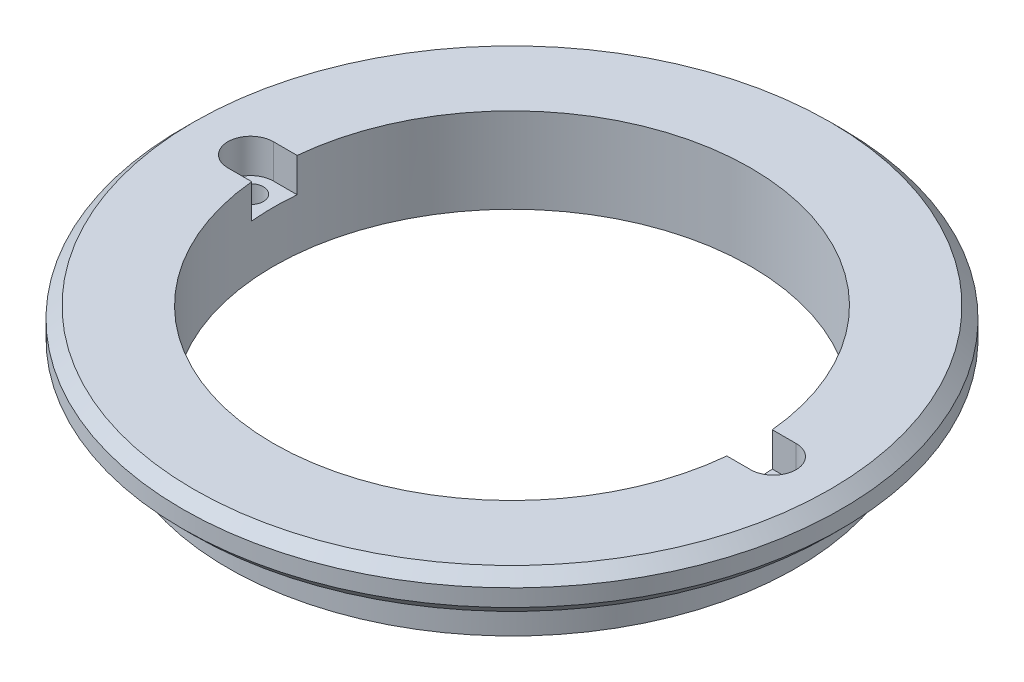
ISO-10303-21;
HEADER;
FILE_DESCRIPTION(('STEP AP214'),'2;1');
FILE_NAME('part.step','',(''),(''),'','','');
FILE_SCHEMA(('AUTOMOTIVE_DESIGN { 1 0 10303 214 1 1 1 1 }'));
ENDSEC;
DATA;
#1=APPLICATION_CONTEXT('core data for automotive mechanical design processes');
#2=APPLICATION_PROTOCOL_DEFINITION('international standard','automotive_design',2000,#1);
#3=PRODUCT_CONTEXT('',#1,'mechanical');
#4=PRODUCT('Part','Part','',(#3));
#5=PRODUCT_RELATED_PRODUCT_CATEGORY('part','',(#4));
#6=PRODUCT_DEFINITION_FORMATION('','',#4);
#7=PRODUCT_DEFINITION_CONTEXT('part definition',#1,'design');
#8=PRODUCT_DEFINITION('design','',#6,#7);
#9=PRODUCT_DEFINITION_SHAPE('','',#8);
#10=(LENGTH_UNIT() NAMED_UNIT(*) SI_UNIT(.MILLI.,.METRE.));
#11=(NAMED_UNIT(*) PLANE_ANGLE_UNIT() SI_UNIT($,.RADIAN.));
#12=(NAMED_UNIT(*) SI_UNIT($,.STERADIAN.) SOLID_ANGLE_UNIT());
#13=UNCERTAINTY_MEASURE_WITH_UNIT(LENGTH_MEASURE(1.E-05),#10,'distance_accuracy_value','');
#14=(GEOMETRIC_REPRESENTATION_CONTEXT(3) GLOBAL_UNCERTAINTY_ASSIGNED_CONTEXT((#13)) GLOBAL_UNIT_ASSIGNED_CONTEXT((#10,
#11,#12)) REPRESENTATION_CONTEXT('',''));
#15=CARTESIAN_POINT('',(0.,0.,0.));
#16=DIRECTION('',(0.,0.,1.));
#17=DIRECTION('',(1.,0.,0.));
#18=AXIS2_PLACEMENT_3D('',#15,#16,#17);
#19=CARTESIAN_POINT('',(23.,7.5,0.));
#20=DIRECTION('',(0.,-1.,0.));
#21=DIRECTION('',(0.,0.,-1.));
#22=AXIS2_PLACEMENT_3D('',#19,#20,#21);
#23=CYLINDRICAL_SURFACE('',#22,1.125);
#24=CARTESIAN_POINT('',(23.,0.,0.));
#25=DIRECTION('',(0.,-1.,0.));
#26=DIRECTION('',(0.,0.,-1.));
#27=AXIS2_PLACEMENT_3D('',#24,#25,#26);
#28=CIRCLE('',#27,1.125);
#29=CARTESIAN_POINT('',(23.,0.,-1.125));
#30=VERTEX_POINT('',#29);
#31=EDGE_CURVE('E191',#30,#30,#28,.T.);
#32=ORIENTED_EDGE('',*,*,#31,.T.);
#33=EDGE_LOOP('',(#32));
#34=FACE_BOUND('',#33,.T.);
#35=CARTESIAN_POINT('',(23.,4.5,0.));
#36=DIRECTION('',(0.,1.,0.));
#37=DIRECTION('',(0.,0.,1.));
#38=AXIS2_PLACEMENT_3D('',#35,#36,#37);
#39=CIRCLE('',#38,1.125);
#40=CARTESIAN_POINT('',(23.,4.5,1.125));
#41=VERTEX_POINT('',#40);
#42=EDGE_CURVE('E171',#41,#41,#39,.F.);
#43=ORIENTED_EDGE('',*,*,#42,.F.);
#44=EDGE_LOOP('',(#43));
#45=FACE_BOUND('',#44,.T.);
#46=ADVANCED_FACE('F45',(#34,#45),#23,.F.);
#47=CARTESIAN_POINT('',(-23.,7.5,0.));
#48=DIRECTION('',(0.,-1.,0.));
#49=DIRECTION('',(0.,0.,-1.));
#50=AXIS2_PLACEMENT_3D('',#47,#48,#49);
#51=CYLINDRICAL_SURFACE('',#50,1.125);
#52=CARTESIAN_POINT('',(-23.,0.,0.));
#53=DIRECTION('',(0.,-1.,0.));
#54=DIRECTION('',(0.,0.,-1.));
#55=AXIS2_PLACEMENT_3D('',#52,#53,#54);
#56=CIRCLE('',#55,1.125);
#57=CARTESIAN_POINT('',(-23.,0.,-1.125));
#58=VERTEX_POINT('',#57);
#59=EDGE_CURVE('E192',#58,#58,#56,.T.);
#60=ORIENTED_EDGE('',*,*,#59,.T.);
#61=EDGE_LOOP('',(#60));
#62=FACE_BOUND('',#61,.T.);
#63=CARTESIAN_POINT('',(-23.,4.5,0.));
#64=DIRECTION('',(0.,1.,0.));
#65=DIRECTION('',(0.,0.,1.));
#66=AXIS2_PLACEMENT_3D('',#63,#64,#65);
#67=CIRCLE('',#66,1.125);
#68=CARTESIAN_POINT('',(-23.,4.5,1.125));
#69=VERTEX_POINT('',#68);
#70=EDGE_CURVE('E49',#69,#69,#67,.F.);
#71=ORIENTED_EDGE('',*,*,#70,.F.);
#72=EDGE_LOOP('',(#71));
#73=FACE_BOUND('',#72,.T.);
#74=ADVANCED_FACE('F291',(#62,#73),#51,.F.);
#75=CARTESIAN_POINT('',(0.,0.,0.));
#76=DIRECTION('',(0.,-1.,0.));
#77=DIRECTION('',(0.,0.,-1.));
#78=AXIS2_PLACEMENT_3D('',#75,#76,#77);
#79=CYLINDRICAL_SURFACE('',#78,21.);
#80=CARTESIAN_POINT('',(0.,7.5,0.));
#81=DIRECTION('',(0.,-1.,0.));
#82=DIRECTION('',(0.,0.,-1.));
#83=AXIS2_PLACEMENT_3D('',#80,#81,#82);
#84=CIRCLE('',#83,21.);
#85=CARTESIAN_POINT('',(-20.9045449603669,7.5,-2.));
#86=VERTEX_POINT('',#85);
#87=CARTESIAN_POINT('',(20.9045449603669,7.5,-2.));
#88=VERTEX_POINT('',#87);
#89=EDGE_CURVE('E196',#86,#88,#84,.T.);
#90=ORIENTED_EDGE('',*,*,#89,.F.);
#91=DIRECTION('',(0.,-1.,0.));
#92=VECTOR('',#91,1.);
#93=CARTESIAN_POINT('',(-20.9045449603669,0.,-2.));
#94=LINE('',#93,#92);
#95=CARTESIAN_POINT('',(-20.9045449603669,4.5,-2.));
#96=VERTEX_POINT('',#95);
#97=EDGE_CURVE('E183',#86,#96,#94,.T.);
#98=ORIENTED_EDGE('',*,*,#97,.T.);
#99=CARTESIAN_POINT('',(0.,4.5,0.));
#100=DIRECTION('',(0.,1.,0.));
#101=DIRECTION('',(0.,0.,1.));
#102=AXIS2_PLACEMENT_3D('',#99,#100,#101);
#103=CIRCLE('',#102,21.);
#104=CARTESIAN_POINT('',(-20.9045449603669,4.5,2.));
#105=VERTEX_POINT('',#104);
#106=EDGE_CURVE('E178',#105,#96,#103,.F.);
#107=ORIENTED_EDGE('',*,*,#106,.F.);
#108=DIRECTION('',(0.,-1.,0.));
#109=VECTOR('',#108,1.);
#110=CARTESIAN_POINT('',(-20.9045449603669,0.,2.));
#111=LINE('',#110,#109);
#112=CARTESIAN_POINT('',(-20.9045449603669,7.5,2.));
#113=VERTEX_POINT('',#112);
#114=EDGE_CURVE('E127',#105,#113,#111,.F.);
#115=ORIENTED_EDGE('',*,*,#114,.T.);
#116=CARTESIAN_POINT('',(20.9045449603669,7.5,2.));
#117=VERTEX_POINT('',#116);
#118=EDGE_CURVE('E203',#117,#113,#84,.T.);
#119=ORIENTED_EDGE('',*,*,#118,.F.);
#120=DIRECTION('',(0.,-1.,0.));
#121=VECTOR('',#120,1.);
#122=CARTESIAN_POINT('',(20.9045449603669,0.,2.));
#123=LINE('',#122,#121);
#124=CARTESIAN_POINT('',(20.9045449603669,4.5,2.));
#125=VERTEX_POINT('',#124);
#126=EDGE_CURVE('E70',#117,#125,#123,.T.);
#127=ORIENTED_EDGE('',*,*,#126,.T.);
#128=CARTESIAN_POINT('',(20.9045449603669,4.5,-2.));
#129=VERTEX_POINT('',#128);
#130=EDGE_CURVE('E175',#129,#125,#103,.F.);
#131=ORIENTED_EDGE('',*,*,#130,.F.);
#132=DIRECTION('',(0.,-1.,0.));
#133=VECTOR('',#132,1.);
#134=CARTESIAN_POINT('',(20.9045449603669,0.,-2.));
#135=LINE('',#134,#133);
#136=EDGE_CURVE('E187',#129,#88,#135,.F.);
#137=ORIENTED_EDGE('',*,*,#136,.T.);
#138=EDGE_LOOP('',(#90,#98,#107,#115,#119,#127,#131,#137));
#139=FACE_BOUND('',#138,.T.);
#140=CARTESIAN_POINT('',(0.,0.,0.));
#141=DIRECTION('',(0.,-1.,0.));
#142=DIRECTION('',(0.,0.,-1.));
#143=AXIS2_PLACEMENT_3D('',#140,#141,#142);
#144=CIRCLE('',#143,21.);
#145=CARTESIAN_POINT('',(0.,0.,-21.));
#146=VERTEX_POINT('',#145);
#147=EDGE_CURVE('E11',#146,#146,#144,.T.);
#148=ORIENTED_EDGE('',*,*,#147,.T.);
#149=EDGE_LOOP('',(#148));
#150=FACE_BOUND('',#149,.T.);
#151=ADVANCED_FACE('F47',(#139,#150),#79,.F.);
#152=CARTESIAN_POINT('',(-21.,0.,0.));
#153=DIRECTION('',(0.,1.,0.));
#154=DIRECTION('',(0.,0.,1.));
#155=AXIS2_PLACEMENT_3D('',#152,#153,#154);
#156=PLANE('',#155);
#157=ORIENTED_EDGE('',*,*,#59,.F.);
#158=EDGE_LOOP('',(#157));
#159=FACE_BOUND('',#158,.T.);
#160=ORIENTED_EDGE('',*,*,#31,.F.);
#161=EDGE_LOOP('',(#160));
#162=FACE_BOUND('',#161,.T.);
#163=ORIENTED_EDGE('',*,*,#147,.F.);
#164=EDGE_LOOP('',(#163));
#165=FACE_BOUND('',#164,.T.);
#166=CARTESIAN_POINT('',(0.,0.,0.));
#167=DIRECTION('',(0.,-1.,0.));
#168=DIRECTION('',(0.,0.,-1.));
#169=AXIS2_PLACEMENT_3D('',#166,#167,#168);
#170=CIRCLE('',#169,25.);
#171=CARTESIAN_POINT('',(0.,0.,-25.));
#172=VERTEX_POINT('',#171);
#173=EDGE_CURVE('E55',#172,#172,#170,.T.);
#174=ORIENTED_EDGE('',*,*,#173,.T.);
#175=EDGE_LOOP('',(#174));
#176=FACE_BOUND('',#175,.T.);
#177=ADVANCED_FACE('F228',(#159,#162,#165,#176),#156,.F.);
#178=CARTESIAN_POINT('',(0.,0.,0.));
#179=DIRECTION('',(0.,-1.,0.));
#180=DIRECTION('',(0.,0.,-1.));
#181=AXIS2_PLACEMENT_3D('',#178,#179,#180);
#182=CYLINDRICAL_SURFACE('',#181,25.);
#183=ORIENTED_EDGE('',*,*,#173,.F.);
#184=EDGE_LOOP('',(#183));
#185=FACE_BOUND('',#184,.T.);
#186=CARTESIAN_POINT('',(0.,4.,0.));
#187=DIRECTION('',(0.,-1.,0.));
#188=DIRECTION('',(0.,0.,-1.));
#189=AXIS2_PLACEMENT_3D('',#186,#187,#188);
#190=CIRCLE('',#189,25.);
#191=CARTESIAN_POINT('',(0.,4.,-25.));
#192=VERTEX_POINT('',#191);
#193=EDGE_CURVE('E220',#192,#192,#190,.T.);
#194=ORIENTED_EDGE('',*,*,#193,.T.);
#195=EDGE_LOOP('',(#194));
#196=FACE_BOUND('',#195,.T.);
#197=ADVANCED_FACE('F230',(#185,#196),#182,.T.);
#198=CARTESIAN_POINT('',(-28.,4.,0.));
#199=DIRECTION('',(0.,1.,0.));
#200=DIRECTION('',(0.,0.,1.));
#201=AXIS2_PLACEMENT_3D('',#198,#199,#200);
#202=PLANE('',#201);
#203=ORIENTED_EDGE('',*,*,#193,.F.);
#204=EDGE_LOOP('',(#203));
#205=FACE_BOUND('',#204,.T.);
#206=CARTESIAN_POINT('',(0.,4.,0.));
#207=DIRECTION('',(0.,-1.,0.));
#208=DIRECTION('',(0.,0.,-1.));
#209=AXIS2_PLACEMENT_3D('',#206,#207,#208);
#210=CIRCLE('',#209,28.);
#211=CARTESIAN_POINT('',(0.,4.,-28.));
#212=VERTEX_POINT('',#211);
#213=EDGE_CURVE('E216',#212,#212,#210,.T.);
#214=ORIENTED_EDGE('',*,*,#213,.T.);
#215=EDGE_LOOP('',(#214));
#216=FACE_BOUND('',#215,.T.);
#217=ADVANCED_FACE('F233',(#205,#216),#202,.F.);
#218=CARTESIAN_POINT('',(0.,5.,0.));
#219=DIRECTION('',(0.,1.,0.));
#220=DIRECTION('',(0.,0.,1.));
#221=AXIS2_PLACEMENT_3D('',#218,#219,#220);
#222=CONICAL_SURFACE('',#221,29.,0.785398163397449);
#223=ORIENTED_EDGE('',*,*,#213,.F.);
#224=EDGE_LOOP('',(#223));
#225=FACE_BOUND('',#224,.T.);
#226=CARTESIAN_POINT('',(0.,5.,0.));
#227=DIRECTION('',(0.,-1.,0.));
#228=DIRECTION('',(0.,0.,-1.));
#229=AXIS2_PLACEMENT_3D('',#226,#227,#228);
#230=CIRCLE('',#229,29.);
#231=CARTESIAN_POINT('',(0.,5.,-29.));
#232=VERTEX_POINT('',#231);
#233=EDGE_CURVE('E212',#232,#232,#230,.T.);
#234=ORIENTED_EDGE('',*,*,#233,.T.);
#235=EDGE_LOOP('',(#234));
#236=FACE_BOUND('',#235,.T.);
#237=ADVANCED_FACE('F239',(#225,#236),#222,.T.);
#238=CARTESIAN_POINT('',(0.,0.,0.));
#239=DIRECTION('',(0.,-1.,0.));
#240=DIRECTION('',(0.,0.,-1.));
#241=AXIS2_PLACEMENT_3D('',#238,#239,#240);
#242=CYLINDRICAL_SURFACE('',#241,29.);
#243=ORIENTED_EDGE('',*,*,#233,.F.);
#244=EDGE_LOOP('',(#243));
#245=FACE_BOUND('',#244,.T.);
#246=CARTESIAN_POINT('',(0.,6.5,0.));
#247=DIRECTION('',(0.,-1.,0.));
#248=DIRECTION('',(0.,0.,-1.));
#249=AXIS2_PLACEMENT_3D('',#246,#247,#248);
#250=CIRCLE('',#249,29.);
#251=CARTESIAN_POINT('',(0.,6.5,-29.));
#252=VERTEX_POINT('',#251);
#253=EDGE_CURVE('E208',#252,#252,#250,.T.);
#254=ORIENTED_EDGE('',*,*,#253,.T.);
#255=EDGE_LOOP('',(#254));
#256=FACE_BOUND('',#255,.T.);
#257=ADVANCED_FACE('F245',(#245,#256),#242,.T.);
#258=CARTESIAN_POINT('',(0.,7.5,0.));
#259=DIRECTION('',(0.,-1.,0.));
#260=DIRECTION('',(0.,0.,-1.));
#261=AXIS2_PLACEMENT_3D('',#258,#259,#260);
#262=CONICAL_SURFACE('',#261,28.,0.785398163397449);
#263=ORIENTED_EDGE('',*,*,#253,.F.);
#264=EDGE_LOOP('',(#263));
#265=FACE_BOUND('',#264,.T.);
#266=CARTESIAN_POINT('',(0.,7.5,0.));
#267=DIRECTION('',(0.,-1.,0.));
#268=DIRECTION('',(0.,0.,-1.));
#269=AXIS2_PLACEMENT_3D('',#266,#267,#268);
#270=CIRCLE('',#269,28.);
#271=CARTESIAN_POINT('',(0.,7.5,-28.));
#272=VERTEX_POINT('',#271);
#273=EDGE_CURVE('E204',#272,#272,#270,.T.);
#274=ORIENTED_EDGE('',*,*,#273,.T.);
#275=EDGE_LOOP('',(#274));
#276=FACE_BOUND('',#275,.T.);
#277=ADVANCED_FACE('F251',(#265,#276),#262,.T.);
#278=CARTESIAN_POINT('',(-28.,7.5,0.));
#279=DIRECTION('',(0.,-1.,0.));
#280=DIRECTION('',(0.,0.,-1.));
#281=AXIS2_PLACEMENT_3D('',#278,#279,#280);
#282=PLANE('',#281);
#283=ORIENTED_EDGE('',*,*,#273,.F.);
#284=EDGE_LOOP('',(#283));
#285=FACE_BOUND('',#284,.T.);
#286=ORIENTED_EDGE('',*,*,#89,.T.);
#287=DIRECTION('',(-1.,0.,0.));
#288=VECTOR('',#287,1.);
#289=CARTESIAN_POINT('',(-23.,7.5,-2.));
#290=LINE('',#289,#288);
#291=CARTESIAN_POINT('',(23.,7.5,-2.));
#292=VERTEX_POINT('',#291);
#293=EDGE_CURVE('E139',#292,#88,#290,.T.);
#294=ORIENTED_EDGE('',*,*,#293,.F.);
#295=CARTESIAN_POINT('',(23.,7.5,0.));
#296=DIRECTION('',(0.,1.,0.));
#297=DIRECTION('',(0.,0.,1.));
#298=AXIS2_PLACEMENT_3D('',#295,#296,#297);
#299=CIRCLE('',#298,2.);
#300=CARTESIAN_POINT('',(23.,7.5,2.));
#301=VERTEX_POINT('',#300);
#302=EDGE_CURVE('E158',#301,#292,#299,.T.);
#303=ORIENTED_EDGE('',*,*,#302,.F.);
#304=DIRECTION('',(1.,0.,0.));
#305=VECTOR('',#304,1.);
#306=CARTESIAN_POINT('',(-23.,7.5,2.));
#307=LINE('',#306,#305);
#308=EDGE_CURVE('E154',#117,#301,#307,.T.);
#309=ORIENTED_EDGE('',*,*,#308,.F.);
#310=ORIENTED_EDGE('',*,*,#118,.T.);
#311=CARTESIAN_POINT('',(-23.,7.5,2.));
#312=VERTEX_POINT('',#311);
#313=EDGE_CURVE('E155',#312,#113,#307,.T.);
#314=ORIENTED_EDGE('',*,*,#313,.F.);
#315=CARTESIAN_POINT('',(-23.,7.5,0.));
#316=DIRECTION('',(0.,1.,0.));
#317=DIRECTION('',(0.,0.,1.));
#318=AXIS2_PLACEMENT_3D('',#315,#316,#317);
#319=CIRCLE('',#318,2.);
#320=CARTESIAN_POINT('',(-23.,7.5,-2.));
#321=VERTEX_POINT('',#320);
#322=EDGE_CURVE('E62',#321,#312,#319,.T.);
#323=ORIENTED_EDGE('',*,*,#322,.F.);
#324=EDGE_CURVE('E143',#86,#321,#290,.T.);
#325=ORIENTED_EDGE('',*,*,#324,.F.);
#326=EDGE_LOOP('',(#286,#294,#303,#309,#310,#314,#323,#325));
#327=FACE_BOUND('',#326,.T.);
#328=ADVANCED_FACE('F257',(#285,#327),#282,.F.);
#329=CARTESIAN_POINT('',(-23.,4.5,0.));
#330=DIRECTION('',(0.,1.,0.));
#331=DIRECTION('',(0.,0.,1.));
#332=AXIS2_PLACEMENT_3D('',#329,#330,#331);
#333=PLANE('',#332);
#334=ORIENTED_EDGE('',*,*,#70,.T.);
#335=EDGE_LOOP('',(#334));
#336=FACE_BOUND('',#335,.T.);
#337=ORIENTED_EDGE('',*,*,#106,.T.);
#338=DIRECTION('',(-1.,0.,0.));
#339=VECTOR('',#338,1.);
#340=CARTESIAN_POINT('',(-23.,4.5,-2.));
#341=LINE('',#340,#339);
#342=CARTESIAN_POINT('',(-23.,4.5,-2.));
#343=VERTEX_POINT('',#342);
#344=EDGE_CURVE('E136',#96,#343,#341,.T.);
#345=ORIENTED_EDGE('',*,*,#344,.T.);
#346=CARTESIAN_POINT('',(-23.,4.5,0.));
#347=DIRECTION('',(0.,1.,0.));
#348=DIRECTION('',(0.,0.,1.));
#349=AXIS2_PLACEMENT_3D('',#346,#347,#348);
#350=CIRCLE('',#349,2.);
#351=CARTESIAN_POINT('',(-23.,4.5,2.));
#352=VERTEX_POINT('',#351);
#353=EDGE_CURVE('E116',#343,#352,#350,.T.);
#354=ORIENTED_EDGE('',*,*,#353,.T.);
#355=DIRECTION('',(1.,0.,0.));
#356=VECTOR('',#355,1.);
#357=CARTESIAN_POINT('',(-23.,4.5,2.));
#358=LINE('',#357,#356);
#359=EDGE_CURVE('E124',#352,#105,#358,.T.);
#360=ORIENTED_EDGE('',*,*,#359,.T.);
#361=EDGE_LOOP('',(#337,#345,#354,#360));
#362=FACE_BOUND('',#361,.T.);
#363=ADVANCED_FACE('F134',(#336,#362),#333,.T.);
#364=CARTESIAN_POINT('',(-23.,4.5,2.));
#365=DIRECTION('',(0.,0.,1.));
#366=DIRECTION('',(1.,0.,0.));
#367=AXIS2_PLACEMENT_3D('',#364,#365,#366);
#368=PLANE('',#367);
#369=ORIENTED_EDGE('',*,*,#359,.F.);
#370=DIRECTION('',(0.,1.,0.));
#371=VECTOR('',#370,1.);
#372=CARTESIAN_POINT('',(-23.,4.5,2.));
#373=LINE('',#372,#371);
#374=EDGE_CURVE('E112',#352,#312,#373,.T.);
#375=ORIENTED_EDGE('',*,*,#374,.T.);
#376=ORIENTED_EDGE('',*,*,#313,.T.);
#377=ORIENTED_EDGE('',*,*,#114,.F.);
#378=EDGE_LOOP('',(#369,#375,#376,#377));
#379=FACE_BOUND('',#378,.T.);
#380=ADVANCED_FACE('F125',(#379),#368,.F.);
#381=CARTESIAN_POINT('',(-23.,4.5,-2.));
#382=DIRECTION('',(0.,0.,-1.));
#383=DIRECTION('',(-1.,0.,0.));
#384=AXIS2_PLACEMENT_3D('',#381,#382,#383);
#385=PLANE('',#384);
#386=ORIENTED_EDGE('',*,*,#324,.T.);
#387=DIRECTION('',(0.,1.,0.));
#388=VECTOR('',#387,1.);
#389=CARTESIAN_POINT('',(-23.,4.5,-2.));
#390=LINE('',#389,#388);
#391=EDGE_CURVE('E162',#343,#321,#390,.T.);
#392=ORIENTED_EDGE('',*,*,#391,.F.);
#393=ORIENTED_EDGE('',*,*,#344,.F.);
#394=ORIENTED_EDGE('',*,*,#97,.F.);
#395=EDGE_LOOP('',(#386,#392,#393,#394));
#396=FACE_BOUND('',#395,.T.);
#397=ADVANCED_FACE('F328',(#396),#385,.F.);
#398=CARTESIAN_POINT('',(-23.,4.5,0.));
#399=DIRECTION('',(0.,1.,0.));
#400=DIRECTION('',(0.,0.,1.));
#401=AXIS2_PLACEMENT_3D('',#398,#399,#400);
#402=CYLINDRICAL_SURFACE('',#401,2.);
#403=ORIENTED_EDGE('',*,*,#322,.T.);
#404=ORIENTED_EDGE('',*,*,#374,.F.);
#405=ORIENTED_EDGE('',*,*,#353,.F.);
#406=ORIENTED_EDGE('',*,*,#391,.T.);
#407=EDGE_LOOP('',(#403,#404,#405,#406));
#408=FACE_BOUND('',#407,.T.);
#409=ADVANCED_FACE('F114',(#408),#402,.F.);
#410=CARTESIAN_POINT('',(23.,4.5,-2.));
#411=VERTEX_POINT('',#410);
#412=EDGE_CURVE('E121',#411,#129,#341,.T.);
#413=ORIENTED_EDGE('',*,*,#412,.F.);
#414=DIRECTION('',(0.,1.,0.));
#415=VECTOR('',#414,1.);
#416=CARTESIAN_POINT('',(23.,4.5,-2.));
#417=LINE('',#416,#415);
#418=EDGE_CURVE('E165',#411,#292,#417,.T.);
#419=ORIENTED_EDGE('',*,*,#418,.T.);
#420=ORIENTED_EDGE('',*,*,#293,.T.);
#421=ORIENTED_EDGE('',*,*,#136,.F.);
#422=EDGE_LOOP('',(#413,#419,#420,#421));
#423=FACE_BOUND('',#422,.T.);
#424=ADVANCED_FACE('F273',(#423),#385,.F.);
#425=ORIENTED_EDGE('',*,*,#308,.T.);
#426=DIRECTION('',(0.,1.,0.));
#427=VECTOR('',#426,1.);
#428=CARTESIAN_POINT('',(23.,4.5,2.));
#429=LINE('',#428,#427);
#430=CARTESIAN_POINT('',(23.,4.5,2.));
#431=VERTEX_POINT('',#430);
#432=EDGE_CURVE('E120',#431,#301,#429,.T.);
#433=ORIENTED_EDGE('',*,*,#432,.F.);
#434=EDGE_CURVE('E132',#125,#431,#358,.T.);
#435=ORIENTED_EDGE('',*,*,#434,.F.);
#436=ORIENTED_EDGE('',*,*,#126,.F.);
#437=EDGE_LOOP('',(#425,#433,#435,#436));
#438=FACE_BOUND('',#437,.T.);
#439=ADVANCED_FACE('F316',(#438),#368,.F.);
#440=ORIENTED_EDGE('',*,*,#42,.T.);
#441=EDGE_LOOP('',(#440));
#442=FACE_BOUND('',#441,.T.);
#443=ORIENTED_EDGE('',*,*,#130,.T.);
#444=ORIENTED_EDGE('',*,*,#434,.T.);
#445=CARTESIAN_POINT('',(23.,4.5,0.));
#446=DIRECTION('',(0.,1.,0.));
#447=DIRECTION('',(0.,0.,1.));
#448=AXIS2_PLACEMENT_3D('',#445,#446,#447);
#449=CIRCLE('',#448,2.);
#450=EDGE_CURVE('E131',#431,#411,#449,.T.);
#451=ORIENTED_EDGE('',*,*,#450,.T.);
#452=ORIENTED_EDGE('',*,*,#412,.T.);
#453=EDGE_LOOP('',(#443,#444,#451,#452));
#454=FACE_BOUND('',#453,.T.);
#455=ADVANCED_FACE('F275',(#442,#454),#333,.T.);
#456=CARTESIAN_POINT('',(23.,4.5,0.));
#457=DIRECTION('',(0.,1.,0.));
#458=DIRECTION('',(0.,0.,1.));
#459=AXIS2_PLACEMENT_3D('',#456,#457,#458);
#460=CYLINDRICAL_SURFACE('',#459,2.);
#461=ORIENTED_EDGE('',*,*,#302,.T.);
#462=ORIENTED_EDGE('',*,*,#418,.F.);
#463=ORIENTED_EDGE('',*,*,#450,.F.);
#464=ORIENTED_EDGE('',*,*,#432,.T.);
#465=EDGE_LOOP('',(#461,#462,#463,#464));
#466=FACE_BOUND('',#465,.T.);
#467=ADVANCED_FACE('F279',(#466),#460,.F.);
#468=CLOSED_SHELL('',(#46,#74,#151,#177,#197,#217,#237,#257,#277,#328,#363,#380,#397,#409,#424,
#439,#455,#467));
#469=MANIFOLD_SOLID_BREP('B2',#468);
#470=ADVANCED_BREP_SHAPE_REPRESENTATION('',(#18,#469),#14);
#471=SHAPE_DEFINITION_REPRESENTATION(#9,#470);
ENDSEC;
END-ISO-10303-21;
